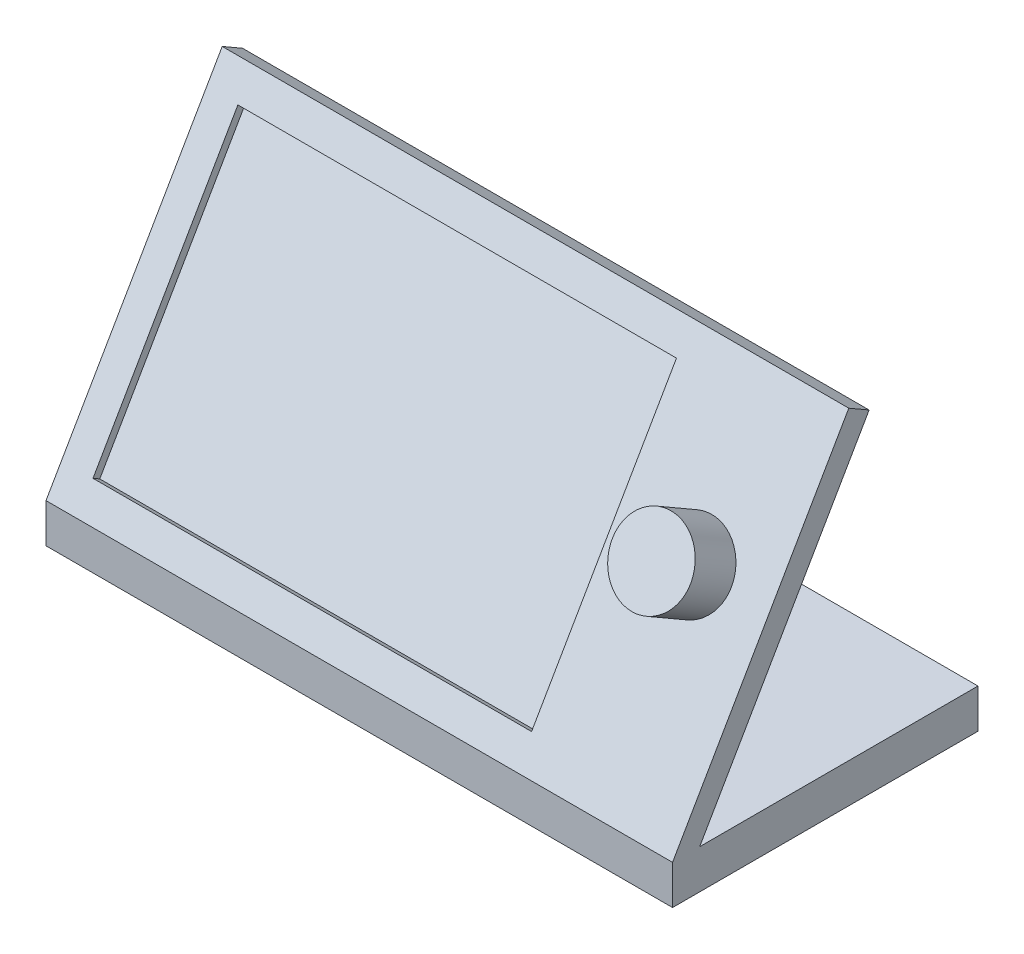
ISO-10303-21;
HEADER;
FILE_DESCRIPTION(('STEP AP214'),'2;1');
FILE_NAME('part.step','',(''),(''),'','','');
FILE_SCHEMA(('AUTOMOTIVE_DESIGN { 1 0 10303 214 1 1 1 1 }'));
ENDSEC;
DATA;
#1=APPLICATION_CONTEXT('core data for automotive mechanical design processes');
#2=APPLICATION_PROTOCOL_DEFINITION('international standard','automotive_design',2000,#1);
#3=PRODUCT_CONTEXT('',#1,'mechanical');
#4=PRODUCT('Part','Part','',(#3));
#5=PRODUCT_RELATED_PRODUCT_CATEGORY('part','',(#4));
#6=PRODUCT_DEFINITION_FORMATION('','',#4);
#7=PRODUCT_DEFINITION_CONTEXT('part definition',#1,'design');
#8=PRODUCT_DEFINITION('design','',#6,#7);
#9=PRODUCT_DEFINITION_SHAPE('','',#8);
#10=(LENGTH_UNIT() NAMED_UNIT(*) SI_UNIT(.MILLI.,.METRE.));
#11=(NAMED_UNIT(*) PLANE_ANGLE_UNIT() SI_UNIT($,.RADIAN.));
#12=(NAMED_UNIT(*) SI_UNIT($,.STERADIAN.) SOLID_ANGLE_UNIT());
#13=UNCERTAINTY_MEASURE_WITH_UNIT(LENGTH_MEASURE(1.E-05),#10,'distance_accuracy_value','');
#14=(GEOMETRIC_REPRESENTATION_CONTEXT(3) GLOBAL_UNCERTAINTY_ASSIGNED_CONTEXT((#13)) GLOBAL_UNIT_ASSIGNED_CONTEXT((#10,
#11,#12)) REPRESENTATION_CONTEXT('',''));
#15=CARTESIAN_POINT('',(0.,0.,0.));
#16=DIRECTION('',(0.,0.,1.));
#17=DIRECTION('',(1.,0.,0.));
#18=AXIS2_PLACEMENT_3D('',#15,#16,#17);
#19=CARTESIAN_POINT('',(0.,6.35,-24.13));
#20=DIRECTION('',(0.,1.,0.));
#21=DIRECTION('',(-1.,0.,0.));
#22=AXIS2_PLACEMENT_3D('',#19,#20,#21);
#23=PLANE('',#22);
#24=DIRECTION('',(0.,0.,1.));
#25=VECTOR('',#24,1.);
#26=CARTESIAN_POINT('',(-101.6,6.34999999999999,-24.13));
#27=LINE('',#26,#25);
#28=CARTESIAN_POINT('',(-101.6,6.34999999999999,-24.13));
#29=VERTEX_POINT('',#28);
#30=CARTESIAN_POINT('',(-101.6,6.34999999999999,21.0005909487751));
#31=VERTEX_POINT('',#30);
#32=EDGE_CURVE('E211',#29,#31,#27,.T.);
#33=ORIENTED_EDGE('',*,*,#32,.T.);
#34=DIRECTION('',(1.,0.,0.));
#35=VECTOR('',#34,1.);
#36=CARTESIAN_POINT('',(-160.469170585784,6.35,21.0005909487751));
#37=LINE('',#36,#35);
#38=CARTESIAN_POINT('',(0.,6.35,21.0005909487751));
#39=VERTEX_POINT('',#38);
#40=EDGE_CURVE('E179',#31,#39,#37,.T.);
#41=ORIENTED_EDGE('',*,*,#40,.T.);
#42=DIRECTION('',(0.,0.,1.));
#43=VECTOR('',#42,1.);
#44=CARTESIAN_POINT('',(0.,6.35,-24.13));
#45=LINE('',#44,#43);
#46=CARTESIAN_POINT('',(0.,6.35,-24.13));
#47=VERTEX_POINT('',#46);
#48=EDGE_CURVE('E43',#47,#39,#45,.T.);
#49=ORIENTED_EDGE('',*,*,#48,.F.);
#50=DIRECTION('',(-1.,0.,0.));
#51=VECTOR('',#50,1.);
#52=CARTESIAN_POINT('',(0.,6.35,-24.13));
#53=LINE('',#52,#51);
#54=EDGE_CURVE('E202',#47,#29,#53,.T.);
#55=ORIENTED_EDGE('',*,*,#54,.T.);
#56=EDGE_LOOP('',(#33,#41,#49,#55));
#57=FACE_BOUND('',#56,.T.);
#58=ADVANCED_FACE('F39',(#57),#23,.T.);
#59=CARTESIAN_POINT('',(0.,0.,-24.13));
#60=DIRECTION('',(1.,0.,0.));
#61=DIRECTION('',(0.,0.,-1.));
#62=AXIS2_PLACEMENT_3D('',#59,#60,#61);
#63=PLANE('',#62);
#64=ORIENTED_EDGE('',*,*,#48,.T.);
#65=DIRECTION('',(0.,0.86602540378444,-0.499999999999998));
#66=VECTOR('',#65,1.);
#67=CARTESIAN_POINT('',(0.,53.9383518262808,-6.47455678841859));
#68=LINE('',#67,#66);
#69=CARTESIAN_POINT('',(0.,53.9383518262808,-6.47455678841859));
#70=VERTEX_POINT('',#69);
#71=EDGE_CURVE('E64',#39,#70,#68,.T.);
#72=ORIENTED_EDGE('',*,*,#71,.T.);
#73=DIRECTION('',(0.,0.499999999999999,0.866025403784439));
#74=VECTOR('',#73,1.);
#75=CARTESIAN_POINT('',(0.,55.8433518262808,-3.17499999999987));
#76=LINE('',#75,#74);
#77=CARTESIAN_POINT('',(0.,55.8433518262808,-3.17499999999987));
#78=VERTEX_POINT('',#77);
#79=EDGE_CURVE('E170',#70,#78,#76,.T.);
#80=ORIENTED_EDGE('',*,*,#79,.T.);
#81=DIRECTION('',(0.,-0.86602540378444,0.499999999999998));
#82=VECTOR('',#81,1.);
#83=CARTESIAN_POINT('',(0.,6.35,25.4));
#84=LINE('',#83,#82);
#85=CARTESIAN_POINT('',(0.,6.35,25.4));
#86=VERTEX_POINT('',#85);
#87=EDGE_CURVE('E166',#78,#86,#84,.T.);
#88=ORIENTED_EDGE('',*,*,#87,.T.);
#89=DIRECTION('',(0.,1.,0.));
#90=VECTOR('',#89,1.);
#91=CARTESIAN_POINT('',(0.,0.,25.4));
#92=LINE('',#91,#90);
#93=CARTESIAN_POINT('',(0.,0.,25.4));
#94=VERTEX_POINT('',#93);
#95=EDGE_CURVE('E187',#94,#86,#92,.T.);
#96=ORIENTED_EDGE('',*,*,#95,.F.);
#97=DIRECTION('',(0.,0.,1.));
#98=VECTOR('',#97,1.);
#99=CARTESIAN_POINT('',(0.,0.,-24.13));
#100=LINE('',#99,#98);
#101=CARTESIAN_POINT('',(0.,0.,-24.13));
#102=VERTEX_POINT('',#101);
#103=EDGE_CURVE('E11',#102,#94,#100,.T.);
#104=ORIENTED_EDGE('',*,*,#103,.F.);
#105=DIRECTION('',(0.,1.,0.));
#106=VECTOR('',#105,1.);
#107=CARTESIAN_POINT('',(0.,0.,-24.13));
#108=LINE('',#107,#106);
#109=EDGE_CURVE('E199',#102,#47,#108,.T.);
#110=ORIENTED_EDGE('',*,*,#109,.T.);
#111=EDGE_LOOP('',(#64,#72,#80,#88,#96,#104,#110));
#112=FACE_BOUND('',#111,.T.);
#113=ADVANCED_FACE('F41',(#112),#63,.T.);
#114=CARTESIAN_POINT('',(0.,0.,-24.13));
#115=DIRECTION('',(0.,-1.,0.));
#116=DIRECTION('',(1.,0.,0.));
#117=AXIS2_PLACEMENT_3D('',#114,#115,#116);
#118=PLANE('',#117);
#119=ORIENTED_EDGE('',*,*,#103,.T.);
#120=DIRECTION('',(1.,0.,0.));
#121=VECTOR('',#120,1.);
#122=CARTESIAN_POINT('',(0.,0.,25.4));
#123=LINE('',#122,#121);
#124=CARTESIAN_POINT('',(-101.6,0.,25.4));
#125=VERTEX_POINT('',#124);
#126=EDGE_CURVE('E196',#125,#94,#123,.T.);
#127=ORIENTED_EDGE('',*,*,#126,.F.);
#128=DIRECTION('',(0.,0.,1.));
#129=VECTOR('',#128,1.);
#130=CARTESIAN_POINT('',(-101.6,0.,-24.13));
#131=LINE('',#130,#129);
#132=CARTESIAN_POINT('',(-101.6,0.,-24.13));
#133=VERTEX_POINT('',#132);
#134=EDGE_CURVE('E48',#133,#125,#131,.T.);
#135=ORIENTED_EDGE('',*,*,#134,.F.);
#136=DIRECTION('',(1.,0.,0.));
#137=VECTOR('',#136,1.);
#138=CARTESIAN_POINT('',(0.,0.,-24.13));
#139=LINE('',#138,#137);
#140=EDGE_CURVE('E208',#133,#102,#139,.T.);
#141=ORIENTED_EDGE('',*,*,#140,.T.);
#142=EDGE_LOOP('',(#119,#127,#135,#141));
#143=FACE_BOUND('',#142,.T.);
#144=ADVANCED_FACE('F244',(#143),#118,.T.);
#145=CARTESIAN_POINT('',(-101.6,0.,-24.13));
#146=DIRECTION('',(-1.,0.,0.));
#147=DIRECTION('',(0.,0.,1.));
#148=AXIS2_PLACEMENT_3D('',#145,#146,#147);
#149=PLANE('',#148);
#150=ORIENTED_EDGE('',*,*,#134,.T.);
#151=DIRECTION('',(0.,-1.,0.));
#152=VECTOR('',#151,1.);
#153=CARTESIAN_POINT('',(-101.6,0.,25.4));
#154=LINE('',#153,#152);
#155=CARTESIAN_POINT('',(-101.6,6.35,25.4));
#156=VERTEX_POINT('',#155);
#157=EDGE_CURVE('E193',#156,#125,#154,.T.);
#158=ORIENTED_EDGE('',*,*,#157,.F.);
#159=DIRECTION('',(0.,-0.86602540378444,0.499999999999998));
#160=VECTOR('',#159,1.);
#161=CARTESIAN_POINT('',(-101.6,6.35,25.4));
#162=LINE('',#161,#160);
#163=CARTESIAN_POINT('',(-101.6,55.8433518262808,-3.17499999999987));
#164=VERTEX_POINT('',#163);
#165=EDGE_CURVE('E177',#164,#156,#162,.T.);
#166=ORIENTED_EDGE('',*,*,#165,.F.);
#167=DIRECTION('',(0.,0.499999999999999,0.866025403784439));
#168=VECTOR('',#167,1.);
#169=CARTESIAN_POINT('',(-101.6,55.8433518262808,-3.17499999999987));
#170=LINE('',#169,#168);
#171=CARTESIAN_POINT('',(-101.6,53.9383518262808,-6.47455678841859));
#172=VERTEX_POINT('',#171);
#173=EDGE_CURVE('E181',#172,#164,#170,.T.);
#174=ORIENTED_EDGE('',*,*,#173,.F.);
#175=DIRECTION('',(0.,0.86602540378444,-0.499999999999998));
#176=VECTOR('',#175,1.);
#177=CARTESIAN_POINT('',(-101.6,53.9383518262808,-6.47455678841859));
#178=LINE('',#177,#176);
#179=EDGE_CURVE('E169',#31,#172,#178,.T.);
#180=ORIENTED_EDGE('',*,*,#179,.F.);
#181=ORIENTED_EDGE('',*,*,#32,.F.);
#182=DIRECTION('',(0.,-1.,0.));
#183=VECTOR('',#182,1.);
#184=CARTESIAN_POINT('',(-101.6,0.,-24.13));
#185=LINE('',#184,#183);
#186=EDGE_CURVE('E205',#29,#133,#185,.T.);
#187=ORIENTED_EDGE('',*,*,#186,.T.);
#188=EDGE_LOOP('',(#150,#158,#166,#174,#180,#181,#187));
#189=FACE_BOUND('',#188,.T.);
#190=ADVANCED_FACE('F223',(#189),#149,.T.);
#191=CARTESIAN_POINT('',(0.,0.,-24.13));
#192=DIRECTION('',(0.,0.,1.));
#193=DIRECTION('',(1.,0.,0.));
#194=AXIS2_PLACEMENT_3D('',#191,#192,#193);
#195=PLANE('',#194);
#196=ORIENTED_EDGE('',*,*,#109,.F.);
#197=ORIENTED_EDGE('',*,*,#140,.F.);
#198=ORIENTED_EDGE('',*,*,#186,.F.);
#199=ORIENTED_EDGE('',*,*,#54,.F.);
#200=EDGE_LOOP('',(#196,#197,#198,#199));
#201=FACE_BOUND('',#200,.T.);
#202=ADVANCED_FACE('F220',(#201),#195,.F.);
#203=CARTESIAN_POINT('',(0.,0.,25.4));
#204=DIRECTION('',(0.,0.,1.));
#205=DIRECTION('',(1.,0.,0.));
#206=AXIS2_PLACEMENT_3D('',#203,#204,#205);
#207=PLANE('',#206);
#208=ORIENTED_EDGE('',*,*,#95,.T.);
#209=DIRECTION('',(-1.,0.,0.));
#210=VECTOR('',#209,1.);
#211=CARTESIAN_POINT('',(0.,6.35,25.4));
#212=LINE('',#211,#210);
#213=EDGE_CURVE('E190',#86,#156,#212,.T.);
#214=ORIENTED_EDGE('',*,*,#213,.T.);
#215=ORIENTED_EDGE('',*,*,#157,.T.);
#216=ORIENTED_EDGE('',*,*,#126,.T.);
#217=EDGE_LOOP('',(#208,#214,#215,#216));
#218=FACE_BOUND('',#217,.T.);
#219=ADVANCED_FACE('F229',(#218),#207,.T.);
#220=CARTESIAN_POINT('',(-160.469170585784,53.9383518262808,-6.47455678841859));
#221=DIRECTION('',(0.,-0.499999999999998,-0.86602540378444));
#222=DIRECTION('',(0.,0.86602540378444,-0.499999999999998));
#223=AXIS2_PLACEMENT_3D('',#220,#221,#222);
#224=PLANE('',#223);
#225=ORIENTED_EDGE('',*,*,#40,.F.);
#226=ORIENTED_EDGE('',*,*,#179,.T.);
#227=DIRECTION('',(1.,0.,0.));
#228=VECTOR('',#227,1.);
#229=CARTESIAN_POINT('',(-160.469170585784,53.9383518262808,-6.47455678841859));
#230=LINE('',#229,#228);
#231=EDGE_CURVE('E176',#172,#70,#230,.T.);
#232=ORIENTED_EDGE('',*,*,#231,.T.);
#233=ORIENTED_EDGE('',*,*,#71,.F.);
#234=EDGE_LOOP('',(#225,#226,#232,#233));
#235=FACE_BOUND('',#234,.T.);
#236=ADVANCED_FACE('F226',(#235),#224,.T.);
#237=CARTESIAN_POINT('',(-160.469170585784,55.8433518262808,-3.17499999999987));
#238=DIRECTION('',(0.,0.866025403784439,-0.499999999999999));
#239=DIRECTION('',(0.,0.499999999999999,0.866025403784439));
#240=AXIS2_PLACEMENT_3D('',#237,#238,#239);
#241=PLANE('',#240);
#242=ORIENTED_EDGE('',*,*,#231,.F.);
#243=ORIENTED_EDGE('',*,*,#173,.T.);
#244=DIRECTION('',(1.,0.,0.));
#245=VECTOR('',#244,1.);
#246=CARTESIAN_POINT('',(-160.469170585784,55.8433518262808,-3.17499999999987));
#247=LINE('',#246,#245);
#248=EDGE_CURVE('E180',#164,#78,#247,.T.);
#249=ORIENTED_EDGE('',*,*,#248,.T.);
#250=ORIENTED_EDGE('',*,*,#79,.F.);
#251=EDGE_LOOP('',(#242,#243,#249,#250));
#252=FACE_BOUND('',#251,.T.);
#253=ADVANCED_FACE('F228',(#252),#241,.T.);
#254=CARTESIAN_POINT('',(-160.469170585784,6.35,25.4));
#255=DIRECTION('',(0.,0.499999999999998,0.86602540378444));
#256=DIRECTION('',(0.,-0.86602540378444,0.499999999999998));
#257=AXIS2_PLACEMENT_3D('',#254,#255,#256);
#258=PLANE('',#257);
#259=CARTESIAN_POINT('',(-12.7,33.846306570156,9.52500000000007));
#260=DIRECTION('',(0.,0.499999999999998,0.86602540378444));
#261=DIRECTION('',(0.,-0.86602540378444,0.499999999999998));
#262=AXIS2_PLACEMENT_3D('',#259,#260,#261);
#263=CIRCLE('',#262,6.35);
#264=CARTESIAN_POINT('',(-12.7,28.3470452561248,12.7000000000001));
#265=VERTEX_POINT('',#264);
#266=EDGE_CURVE('E150',#265,#265,#263,.T.);
#267=ORIENTED_EDGE('',*,*,#266,.F.);
#268=EDGE_LOOP('',(#267));
#269=FACE_BOUND('',#268,.T.);
#270=DIRECTION('',(0.,-0.86602540378444,0.499999999999998));
#271=VECTOR('',#270,1.);
#272=CARTESIAN_POINT('',(-96.52,51.4439427750558,-0.634999999999882));
#273=LINE('',#272,#271);
#274=CARTESIAN_POINT('',(-96.52,51.4439427750558,-0.634999999999882));
#275=VERTEX_POINT('',#274);
#276=CARTESIAN_POINT('',(-96.52,10.749409051225,22.86));
#277=VERTEX_POINT('',#276);
#278=EDGE_CURVE('E56',#275,#277,#273,.T.);
#279=ORIENTED_EDGE('',*,*,#278,.F.);
#280=DIRECTION('',(-1.,0.,0.));
#281=VECTOR('',#280,1.);
#282=CARTESIAN_POINT('',(-96.52,51.4439427750558,-0.634999999999882));
#283=LINE('',#282,#281);
#284=CARTESIAN_POINT('',(-25.4,51.4439427750558,-0.634999999999882));
#285=VERTEX_POINT('',#284);
#286=EDGE_CURVE('E144',#285,#275,#283,.T.);
#287=ORIENTED_EDGE('',*,*,#286,.F.);
#288=DIRECTION('',(0.,0.86602540378444,-0.499999999999998));
#289=VECTOR('',#288,1.);
#290=CARTESIAN_POINT('',(-25.4,51.4439427750558,-0.634999999999882));
#291=LINE('',#290,#289);
#292=CARTESIAN_POINT('',(-25.4,10.749409051225,22.86));
#293=VERTEX_POINT('',#292);
#294=EDGE_CURVE('E147',#293,#285,#291,.T.);
#295=ORIENTED_EDGE('',*,*,#294,.F.);
#296=DIRECTION('',(1.,0.,0.));
#297=VECTOR('',#296,1.);
#298=CARTESIAN_POINT('',(-96.52,10.749409051225,22.86));
#299=LINE('',#298,#297);
#300=EDGE_CURVE('E156',#277,#293,#299,.T.);
#301=ORIENTED_EDGE('',*,*,#300,.F.);
#302=EDGE_LOOP('',(#279,#287,#295,#301));
#303=FACE_BOUND('',#302,.T.);
#304=ORIENTED_EDGE('',*,*,#248,.F.);
#305=ORIENTED_EDGE('',*,*,#165,.T.);
#306=ORIENTED_EDGE('',*,*,#213,.F.);
#307=ORIENTED_EDGE('',*,*,#87,.F.);
#308=EDGE_LOOP('',(#304,#305,#306,#307));
#309=FACE_BOUND('',#308,.T.);
#310=ADVANCED_FACE('F235',(#269,#303,#309),#258,.T.);
#311=CARTESIAN_POINT('',(-96.52,50.8089427750558,-1.73485226280612));
#312=DIRECTION('',(-1.,0.,0.));
#313=DIRECTION('',(0.,0.,1.));
#314=AXIS2_PLACEMENT_3D('',#311,#312,#313);
#315=PLANE('',#314);
#316=ORIENTED_EDGE('',*,*,#278,.T.);
#317=DIRECTION('',(0.,0.499999999999998,0.86602540378444));
#318=VECTOR('',#317,1.);
#319=CARTESIAN_POINT('',(-96.52,10.114409051225,21.7601477371938));
#320=LINE('',#319,#318);
#321=CARTESIAN_POINT('',(-96.52,10.114409051225,21.7601477371938));
#322=VERTEX_POINT('',#321);
#323=EDGE_CURVE('E122',#322,#277,#320,.T.);
#324=ORIENTED_EDGE('',*,*,#323,.F.);
#325=DIRECTION('',(0.,-0.86602540378444,0.499999999999998));
#326=VECTOR('',#325,1.);
#327=CARTESIAN_POINT('',(-96.52,50.8089427750558,-1.73485226280612));
#328=LINE('',#327,#326);
#329=CARTESIAN_POINT('',(-96.52,50.8089427750558,-1.73485226280612));
#330=VERTEX_POINT('',#329);
#331=EDGE_CURVE('E126',#330,#322,#328,.T.);
#332=ORIENTED_EDGE('',*,*,#331,.F.);
#333=DIRECTION('',(0.,0.499999999999998,0.86602540378444));
#334=VECTOR('',#333,1.);
#335=CARTESIAN_POINT('',(-96.52,50.8089427750558,-1.73485226280612));
#336=LINE('',#335,#334);
#337=EDGE_CURVE('E161',#330,#275,#336,.T.);
#338=ORIENTED_EDGE('',*,*,#337,.T.);
#339=EDGE_LOOP('',(#316,#324,#332,#338));
#340=FACE_BOUND('',#339,.T.);
#341=ADVANCED_FACE('F124',(#340),#315,.F.);
#342=CARTESIAN_POINT('',(-96.52,50.8089427750558,-1.73485226280612));
#343=DIRECTION('',(0.,0.86602540378444,-0.499999999999998));
#344=DIRECTION('',(0.,0.499999999999998,0.86602540378444));
#345=AXIS2_PLACEMENT_3D('',#342,#343,#344);
#346=PLANE('',#345);
#347=ORIENTED_EDGE('',*,*,#286,.T.);
#348=ORIENTED_EDGE('',*,*,#337,.F.);
#349=DIRECTION('',(-1.,0.,0.));
#350=VECTOR('',#349,1.);
#351=CARTESIAN_POINT('',(-96.52,50.8089427750558,-1.73485226280612));
#352=LINE('',#351,#350);
#353=CARTESIAN_POINT('',(-25.4,50.8089427750558,-1.73485226280612));
#354=VERTEX_POINT('',#353);
#355=EDGE_CURVE('E132',#354,#330,#352,.T.);
#356=ORIENTED_EDGE('',*,*,#355,.F.);
#357=DIRECTION('',(0.,0.499999999999998,0.86602540378444));
#358=VECTOR('',#357,1.);
#359=CARTESIAN_POINT('',(-25.4,50.8089427750558,-1.73485226280612));
#360=LINE('',#359,#358);
#361=EDGE_CURVE('E163',#354,#285,#360,.T.);
#362=ORIENTED_EDGE('',*,*,#361,.T.);
#363=EDGE_LOOP('',(#347,#348,#356,#362));
#364=FACE_BOUND('',#363,.T.);
#365=ADVANCED_FACE('F286',(#364),#346,.F.);
#366=CARTESIAN_POINT('',(-25.4,50.8089427750558,-1.73485226280612));
#367=DIRECTION('',(1.,0.,0.));
#368=DIRECTION('',(0.,0.,-1.));
#369=AXIS2_PLACEMENT_3D('',#366,#367,#368);
#370=PLANE('',#369);
#371=ORIENTED_EDGE('',*,*,#294,.T.);
#372=ORIENTED_EDGE('',*,*,#361,.F.);
#373=DIRECTION('',(0.,0.86602540378444,-0.499999999999998));
#374=VECTOR('',#373,1.);
#375=CARTESIAN_POINT('',(-25.4,50.8089427750558,-1.73485226280612));
#376=LINE('',#375,#374);
#377=CARTESIAN_POINT('',(-25.4,10.114409051225,21.7601477371938));
#378=VERTEX_POINT('',#377);
#379=EDGE_CURVE('E140',#378,#354,#376,.T.);
#380=ORIENTED_EDGE('',*,*,#379,.F.);
#381=DIRECTION('',(0.,0.499999999999998,0.86602540378444));
#382=VECTOR('',#381,1.);
#383=CARTESIAN_POINT('',(-25.4,10.114409051225,21.7601477371938));
#384=LINE('',#383,#382);
#385=EDGE_CURVE('E131',#378,#293,#384,.T.);
#386=ORIENTED_EDGE('',*,*,#385,.T.);
#387=EDGE_LOOP('',(#371,#372,#380,#386));
#388=FACE_BOUND('',#387,.T.);
#389=ADVANCED_FACE('F295',(#388),#370,.F.);
#390=CARTESIAN_POINT('',(-96.52,10.114409051225,21.7601477371938));
#391=DIRECTION('',(0.,-0.86602540378444,0.499999999999998));
#392=DIRECTION('',(0.,-0.499999999999998,-0.86602540378444));
#393=AXIS2_PLACEMENT_3D('',#390,#391,#392);
#394=PLANE('',#393);
#395=ORIENTED_EDGE('',*,*,#300,.T.);
#396=ORIENTED_EDGE('',*,*,#385,.F.);
#397=DIRECTION('',(1.,0.,0.));
#398=VECTOR('',#397,1.);
#399=CARTESIAN_POINT('',(-96.52,10.114409051225,21.7601477371938));
#400=LINE('',#399,#398);
#401=EDGE_CURVE('E135',#322,#378,#400,.T.);
#402=ORIENTED_EDGE('',*,*,#401,.F.);
#403=ORIENTED_EDGE('',*,*,#323,.T.);
#404=EDGE_LOOP('',(#395,#396,#402,#403));
#405=FACE_BOUND('',#404,.T.);
#406=ADVANCED_FACE('F136',(#405),#394,.F.);
#407=CARTESIAN_POINT('',(0.,11.9510226280623,20.6997783942094));
#408=DIRECTION('',(0.,0.499999999999998,0.86602540378444));
#409=DIRECTION('',(0.,-0.86602540378444,0.499999999999998));
#410=AXIS2_PLACEMENT_3D('',#407,#408,#409);
#411=PLANE('',#410);
#412=ORIENTED_EDGE('',*,*,#331,.T.);
#413=ORIENTED_EDGE('',*,*,#401,.T.);
#414=ORIENTED_EDGE('',*,*,#379,.T.);
#415=ORIENTED_EDGE('',*,*,#355,.T.);
#416=EDGE_LOOP('',(#412,#413,#414,#415));
#417=FACE_BOUND('',#416,.T.);
#418=ADVANCED_FACE('F142',(#417),#411,.T.);
#419=CARTESIAN_POINT('',(-12.7,37.656306570156,16.1241135768375));
#420=DIRECTION('',(0.,-0.499999999999998,-0.86602540378444));
#421=DIRECTION('',(0.,0.86602540378444,-0.499999999999998));
#422=AXIS2_PLACEMENT_3D('',#419,#420,#421);
#423=CYLINDRICAL_SURFACE('',#422,6.35);
#424=CARTESIAN_POINT('',(-12.7,37.656306570156,16.1241135768375));
#425=DIRECTION('',(0.,0.499999999999998,0.86602540378444));
#426=DIRECTION('',(0.,-0.86602540378444,0.499999999999998));
#427=AXIS2_PLACEMENT_3D('',#424,#425,#426);
#428=CIRCLE('',#427,6.35);
#429=CARTESIAN_POINT('',(-12.7,32.1570452561248,19.2991135768375));
#430=VERTEX_POINT('',#429);
#431=EDGE_CURVE('E157',#430,#430,#428,.T.);
#432=ORIENTED_EDGE('',*,*,#431,.F.);
#433=EDGE_LOOP('',(#432));
#434=FACE_BOUND('',#433,.T.);
#435=ORIENTED_EDGE('',*,*,#266,.T.);
#436=EDGE_LOOP('',(#435));
#437=FACE_BOUND('',#436,.T.);
#438=ADVANCED_FACE('F322',(#434,#437),#423,.T.);
#439=CARTESIAN_POINT('',(-12.7,37.656306570156,16.1241135768375));
#440=DIRECTION('',(0.,0.499999999999998,0.86602540378444));
#441=DIRECTION('',(0.,-0.86602540378444,0.499999999999998));
#442=AXIS2_PLACEMENT_3D('',#439,#440,#441);
#443=PLANE('',#442);
#444=ORIENTED_EDGE('',*,*,#431,.T.);
#445=EDGE_LOOP('',(#444));
#446=FACE_BOUND('',#445,.T.);
#447=ADVANCED_FACE('F338',(#446),#443,.T.);
#448=CLOSED_SHELL('',(#58,#113,#144,#190,#202,#219,#236,#253,#310,#341,#365,#389,#406,#418,#438,#447));
#449=MANIFOLD_SOLID_BREP('B2',#448);
#450=ADVANCED_BREP_SHAPE_REPRESENTATION('',(#18,#449),#14);
#451=SHAPE_DEFINITION_REPRESENTATION(#9,#450);
ENDSEC;
END-ISO-10303-21;
